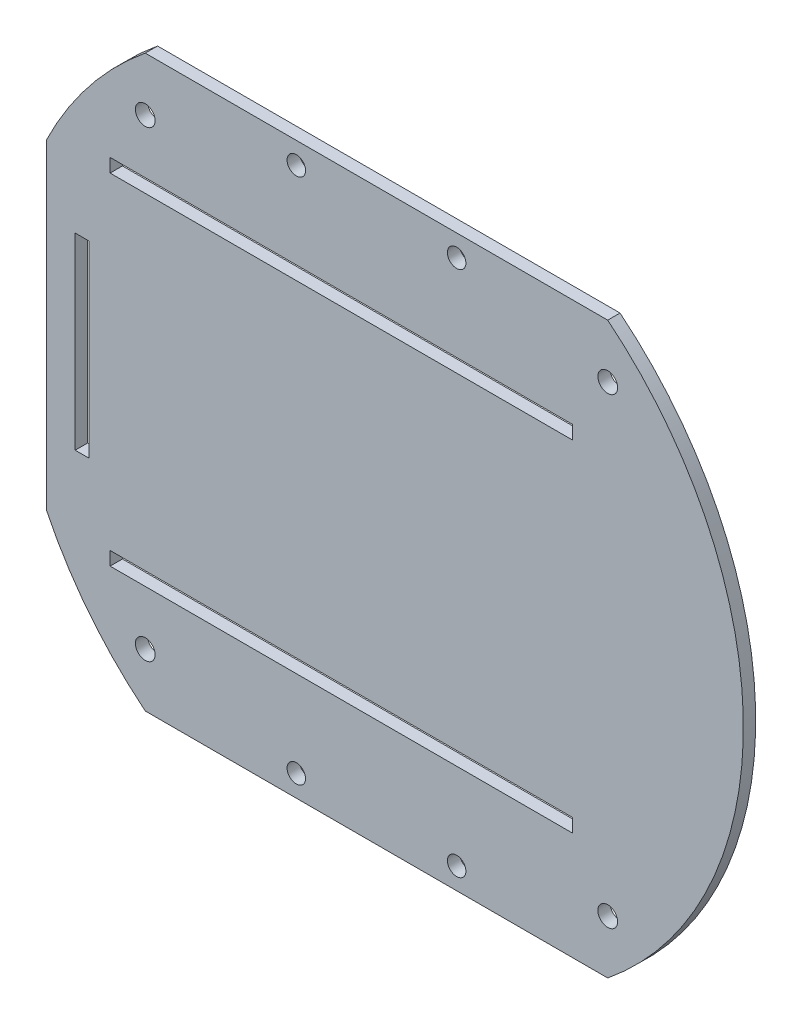
ISO-10303-21;
HEADER;
FILE_DESCRIPTION(('STEP AP214'),'2;1');
FILE_NAME('part.step','',(''),(''),'','','');
FILE_SCHEMA(('AUTOMOTIVE_DESIGN { 1 0 10303 214 1 1 1 1 }'));
ENDSEC;
DATA;
#1=APPLICATION_CONTEXT('core data for automotive mechanical design processes');
#2=APPLICATION_PROTOCOL_DEFINITION('international standard','automotive_design',2000,#1);
#3=PRODUCT_CONTEXT('',#1,'mechanical');
#4=PRODUCT('Part','Part','',(#3));
#5=PRODUCT_RELATED_PRODUCT_CATEGORY('part','',(#4));
#6=PRODUCT_DEFINITION_FORMATION('','',#4);
#7=PRODUCT_DEFINITION_CONTEXT('part definition',#1,'design');
#8=PRODUCT_DEFINITION('design','',#6,#7);
#9=PRODUCT_DEFINITION_SHAPE('','',#8);
#10=(LENGTH_UNIT() NAMED_UNIT(*) SI_UNIT(.MILLI.,.METRE.));
#11=(NAMED_UNIT(*) PLANE_ANGLE_UNIT() SI_UNIT($,.RADIAN.));
#12=(NAMED_UNIT(*) SI_UNIT($,.STERADIAN.) SOLID_ANGLE_UNIT());
#13=UNCERTAINTY_MEASURE_WITH_UNIT(LENGTH_MEASURE(1.E-05),#10,'distance_accuracy_value','');
#14=(GEOMETRIC_REPRESENTATION_CONTEXT(3) GLOBAL_UNCERTAINTY_ASSIGNED_CONTEXT((#13)) GLOBAL_UNIT_ASSIGNED_CONTEXT((#10,
#11,#12)) REPRESENTATION_CONTEXT('',''));
#15=CARTESIAN_POINT('',(0.,0.,0.));
#16=DIRECTION('',(0.,0.,1.));
#17=DIRECTION('',(1.,0.,0.));
#18=AXIS2_PLACEMENT_3D('',#15,#16,#17);
#19=CARTESIAN_POINT('',(0.,0.,2.));
#20=DIRECTION('',(0.,0.,-1.));
#21=DIRECTION('',(-1.,0.,0.));
#22=AXIS2_PLACEMENT_3D('',#19,#20,#21);
#23=CYLINDRICAL_SURFACE('',#22,59.5);
#24=CARTESIAN_POINT('',(0.,0.,0.));
#25=DIRECTION('',(0.,0.,1.));
#26=DIRECTION('',(1.,0.,0.));
#27=AXIS2_PLACEMENT_3D('',#24,#25,#26);
#28=CIRCLE('',#27,59.5);
#29=CARTESIAN_POINT('',(-53.5186883247338,-26.,0.));
#30=VERTEX_POINT('',#29);
#31=CARTESIAN_POINT('',(-37.5,-46.1952378498044,0.));
#32=VERTEX_POINT('',#31);
#33=EDGE_CURVE('E330',#30,#32,#28,.T.);
#34=ORIENTED_EDGE('',*,*,#33,.T.);
#35=DIRECTION('',(0.,0.,1.));
#36=VECTOR('',#35,1.);
#37=CARTESIAN_POINT('',(-37.5,-46.1952378498044,-76.1709701649735));
#38=LINE('',#37,#36);
#39=CARTESIAN_POINT('',(-37.5,-46.1952378498044,2.));
#40=VERTEX_POINT('',#39);
#41=EDGE_CURVE('E49',#32,#40,#38,.T.);
#42=ORIENTED_EDGE('',*,*,#41,.T.);
#43=CARTESIAN_POINT('',(0.,0.,2.));
#44=DIRECTION('',(0.,0.,1.));
#45=DIRECTION('',(1.,0.,0.));
#46=AXIS2_PLACEMENT_3D('',#43,#44,#45);
#47=CIRCLE('',#46,59.5);
#48=CARTESIAN_POINT('',(-53.5186883247338,-26.,2.));
#49=VERTEX_POINT('',#48);
#50=EDGE_CURVE('E41',#49,#40,#47,.T.);
#51=ORIENTED_EDGE('',*,*,#50,.F.);
#52=DIRECTION('',(0.,0.,1.));
#53=VECTOR('',#52,1.);
#54=CARTESIAN_POINT('',(-53.5186883247338,-26.,-76.1709701649735));
#55=LINE('',#54,#53);
#56=EDGE_CURVE('E182',#30,#49,#55,.T.);
#57=ORIENTED_EDGE('',*,*,#56,.F.);
#58=EDGE_LOOP('',(#34,#42,#51,#57));
#59=FACE_BOUND('',#58,.T.);
#60=ADVANCED_FACE('F32',(#59),#23,.T.);
#61=CARTESIAN_POINT('',(-37.5,46.1952378498044,2.));
#62=VERTEX_POINT('',#61);
#63=CARTESIAN_POINT('',(-53.5186883247338,26.,2.));
#64=VERTEX_POINT('',#63);
#65=EDGE_CURVE('E11',#62,#64,#47,.T.);
#66=ORIENTED_EDGE('',*,*,#65,.F.);
#67=DIRECTION('',(0.,0.,1.));
#68=VECTOR('',#67,1.);
#69=CARTESIAN_POINT('',(-37.5,46.1952378498044,-76.1709701649735));
#70=LINE('',#69,#68);
#71=CARTESIAN_POINT('',(-37.5,46.1952378498044,0.));
#72=VERTEX_POINT('',#71);
#73=EDGE_CURVE('E158',#72,#62,#70,.T.);
#74=ORIENTED_EDGE('',*,*,#73,.F.);
#75=CARTESIAN_POINT('',(-53.5186883247338,26.,0.));
#76=VERTEX_POINT('',#75);
#77=EDGE_CURVE('E181',#72,#76,#28,.T.);
#78=ORIENTED_EDGE('',*,*,#77,.T.);
#79=DIRECTION('',(0.,0.,1.));
#80=VECTOR('',#79,1.);
#81=CARTESIAN_POINT('',(-53.5186883247338,26.,-76.1709701649735));
#82=LINE('',#81,#80);
#83=EDGE_CURVE('E57',#76,#64,#82,.T.);
#84=ORIENTED_EDGE('',*,*,#83,.T.);
#85=EDGE_LOOP('',(#66,#74,#78,#84));
#86=FACE_BOUND('',#85,.T.);
#87=ADVANCED_FACE('F180',(#86),#23,.T.);
#88=CARTESIAN_POINT('',(37.5,-46.1952378498044,2.));
#89=VERTEX_POINT('',#88);
#90=CARTESIAN_POINT('',(37.5,46.1952378498044,2.));
#91=VERTEX_POINT('',#90);
#92=EDGE_CURVE('E42',#89,#91,#47,.T.);
#93=ORIENTED_EDGE('',*,*,#92,.F.);
#94=DIRECTION('',(0.,0.,1.));
#95=VECTOR('',#94,1.);
#96=CARTESIAN_POINT('',(37.5,-46.1952378498044,-76.1709701649735));
#97=LINE('',#96,#95);
#98=CARTESIAN_POINT('',(37.5,-46.1952378498044,0.));
#99=VERTEX_POINT('',#98);
#100=EDGE_CURVE('E199',#99,#89,#97,.T.);
#101=ORIENTED_EDGE('',*,*,#100,.F.);
#102=CARTESIAN_POINT('',(37.5,46.1952378498044,0.));
#103=VERTEX_POINT('',#102);
#104=EDGE_CURVE('E36',#99,#103,#28,.T.);
#105=ORIENTED_EDGE('',*,*,#104,.T.);
#106=DIRECTION('',(0.,0.,1.));
#107=VECTOR('',#106,1.);
#108=CARTESIAN_POINT('',(37.5,46.1952378498044,-76.1709701649735));
#109=LINE('',#108,#107);
#110=EDGE_CURVE('E169',#103,#91,#109,.T.);
#111=ORIENTED_EDGE('',*,*,#110,.T.);
#112=EDGE_LOOP('',(#93,#101,#105,#111));
#113=FACE_BOUND('',#112,.T.);
#114=ADVANCED_FACE('F34',(#113),#23,.T.);
#115=CARTESIAN_POINT('',(0.,0.,2.));
#116=DIRECTION('',(0.,0.,1.));
#117=DIRECTION('',(1.,0.,0.));
#118=AXIS2_PLACEMENT_3D('',#115,#116,#117);
#119=PLANE('',#118);
#120=DIRECTION('',(-1.,0.,0.));
#121=VECTOR('',#120,1.);
#122=CARTESIAN_POINT('',(-37.5,-46.1952378498044,2.));
#123=LINE('',#122,#121);
#124=EDGE_CURVE('E197',#89,#40,#123,.T.);
#125=ORIENTED_EDGE('',*,*,#124,.F.);
#126=ORIENTED_EDGE('',*,*,#92,.T.);
#127=DIRECTION('',(1.,0.,0.));
#128=VECTOR('',#127,1.);
#129=CARTESIAN_POINT('',(-37.5,46.1952378498044,2.));
#130=LINE('',#129,#128);
#131=EDGE_CURVE('E161',#62,#91,#130,.T.);
#132=ORIENTED_EDGE('',*,*,#131,.F.);
#133=ORIENTED_EDGE('',*,*,#65,.T.);
#134=DIRECTION('',(0.,1.,0.));
#135=VECTOR('',#134,1.);
#136=CARTESIAN_POINT('',(-53.5186883247338,26.,2.));
#137=LINE('',#136,#135);
#138=EDGE_CURVE('E183',#49,#64,#137,.T.);
#139=ORIENTED_EDGE('',*,*,#138,.F.);
#140=ORIENTED_EDGE('',*,*,#50,.T.);
#141=EDGE_LOOP('',(#125,#126,#132,#133,#139,#140));
#142=FACE_BOUND('',#141,.T.);
#143=CARTESIAN_POINT('',(13.,42.7,2.));
#144=DIRECTION('',(0.,0.,1.));
#145=DIRECTION('',(1.,0.,0.));
#146=AXIS2_PLACEMENT_3D('',#143,#144,#145);
#147=CIRCLE('',#146,1.5);
#148=CARTESIAN_POINT('',(14.5,42.7,2.));
#149=VERTEX_POINT('',#148);
#150=EDGE_CURVE('E188',#149,#149,#147,.T.);
#151=ORIENTED_EDGE('',*,*,#150,.F.);
#152=EDGE_LOOP('',(#151));
#153=FACE_BOUND('',#152,.T.);
#154=CARTESIAN_POINT('',(-13.,42.7,2.));
#155=DIRECTION('',(0.,0.,1.));
#156=DIRECTION('',(1.,0.,0.));
#157=AXIS2_PLACEMENT_3D('',#154,#155,#156);
#158=CIRCLE('',#157,1.50000000000001);
#159=CARTESIAN_POINT('',(-11.5,42.7,2.));
#160=VERTEX_POINT('',#159);
#161=EDGE_CURVE('E195',#160,#160,#158,.T.);
#162=ORIENTED_EDGE('',*,*,#161,.F.);
#163=EDGE_LOOP('',(#162));
#164=FACE_BOUND('',#163,.T.);
#165=CARTESIAN_POINT('',(13.,-42.7,2.));
#166=DIRECTION('',(0.,0.,1.));
#167=DIRECTION('',(1.,0.,0.));
#168=AXIS2_PLACEMENT_3D('',#165,#166,#167);
#169=CIRCLE('',#168,1.5);
#170=CARTESIAN_POINT('',(14.5,-42.7,2.));
#171=VERTEX_POINT('',#170);
#172=EDGE_CURVE('E202',#171,#171,#169,.T.);
#173=ORIENTED_EDGE('',*,*,#172,.F.);
#174=EDGE_LOOP('',(#173));
#175=FACE_BOUND('',#174,.T.);
#176=CARTESIAN_POINT('',(-13.,-42.7,2.));
#177=DIRECTION('',(0.,0.,1.));
#178=DIRECTION('',(1.,0.,0.));
#179=AXIS2_PLACEMENT_3D('',#176,#177,#178);
#180=CIRCLE('',#179,1.5);
#181=CARTESIAN_POINT('',(-11.5,-42.7,2.));
#182=VERTEX_POINT('',#181);
#183=EDGE_CURVE('E209',#182,#182,#180,.T.);
#184=ORIENTED_EDGE('',*,*,#183,.F.);
#185=EDGE_LOOP('',(#184));
#186=FACE_BOUND('',#185,.T.);
#187=CARTESIAN_POINT('',(37.5,37.5,2.));
#188=DIRECTION('',(0.,0.,1.));
#189=DIRECTION('',(1.,0.,0.));
#190=AXIS2_PLACEMENT_3D('',#187,#188,#189);
#191=CIRCLE('',#190,1.6);
#192=CARTESIAN_POINT('',(39.1,37.5,2.));
#193=VERTEX_POINT('',#192);
#194=EDGE_CURVE('E219',#193,#193,#191,.T.);
#195=ORIENTED_EDGE('',*,*,#194,.F.);
#196=EDGE_LOOP('',(#195));
#197=FACE_BOUND('',#196,.T.);
#198=CARTESIAN_POINT('',(-37.5,37.5,2.));
#199=DIRECTION('',(0.,0.,1.));
#200=DIRECTION('',(1.,0.,0.));
#201=AXIS2_PLACEMENT_3D('',#198,#199,#200);
#202=CIRCLE('',#201,1.60000000000001);
#203=CARTESIAN_POINT('',(-35.9,37.5,2.));
#204=VERTEX_POINT('',#203);
#205=EDGE_CURVE('E292',#204,#204,#202,.T.);
#206=ORIENTED_EDGE('',*,*,#205,.F.);
#207=EDGE_LOOP('',(#206));
#208=FACE_BOUND('',#207,.T.);
#209=DIRECTION('',(0.,-1.,0.));
#210=VECTOR('',#209,1.);
#211=CARTESIAN_POINT('',(-43.197175449376,-26.5,2.));
#212=LINE('',#211,#210);
#213=CARTESIAN_POINT('',(-43.197175449376,-26.5,2.));
#214=VERTEX_POINT('',#213);
#215=CARTESIAN_POINT('',(-43.197175449376,-28.7,2.));
#216=VERTEX_POINT('',#215);
#217=EDGE_CURVE('E266',#214,#216,#212,.T.);
#218=ORIENTED_EDGE('',*,*,#217,.F.);
#219=DIRECTION('',(-1.,0.,0.));
#220=VECTOR('',#219,1.);
#221=CARTESIAN_POINT('',(-43.197175449376,-26.5,2.));
#222=LINE('',#221,#220);
#223=CARTESIAN_POINT('',(31.802824550624,-26.5,2.));
#224=VERTEX_POINT('',#223);
#225=EDGE_CURVE('E275',#224,#214,#222,.T.);
#226=ORIENTED_EDGE('',*,*,#225,.F.);
#227=DIRECTION('',(0.,1.,0.));
#228=VECTOR('',#227,1.);
#229=CARTESIAN_POINT('',(31.802824550624,-26.5,2.));
#230=LINE('',#229,#228);
#231=CARTESIAN_POINT('',(31.802824550624,-28.7,2.));
#232=VERTEX_POINT('',#231);
#233=EDGE_CURVE('E272',#232,#224,#230,.T.);
#234=ORIENTED_EDGE('',*,*,#233,.F.);
#235=DIRECTION('',(1.,0.,0.));
#236=VECTOR('',#235,1.);
#237=CARTESIAN_POINT('',(-43.197175449376,-28.7,2.));
#238=LINE('',#237,#236);
#239=EDGE_CURVE('E268',#216,#232,#238,.T.);
#240=ORIENTED_EDGE('',*,*,#239,.F.);
#241=EDGE_LOOP('',(#218,#226,#234,#240));
#242=FACE_BOUND('',#241,.T.);
#243=CARTESIAN_POINT('',(37.5,-37.5,2.));
#244=DIRECTION('',(0.,0.,1.));
#245=DIRECTION('',(1.,0.,0.));
#246=AXIS2_PLACEMENT_3D('',#243,#244,#245);
#247=CIRCLE('',#246,1.6);
#248=CARTESIAN_POINT('',(39.1,-37.5,2.));
#249=VERTEX_POINT('',#248);
#250=EDGE_CURVE('E250',#249,#249,#247,.T.);
#251=ORIENTED_EDGE('',*,*,#250,.F.);
#252=EDGE_LOOP('',(#251));
#253=FACE_BOUND('',#252,.T.);
#254=DIRECTION('',(0.,-1.,0.));
#255=VECTOR('',#254,1.);
#256=CARTESIAN_POINT('',(-48.8589023812688,15.25,2.));
#257=LINE('',#256,#255);
#258=CARTESIAN_POINT('',(-48.8589023812688,15.25,2.));
#259=VERTEX_POINT('',#258);
#260=CARTESIAN_POINT('',(-48.8589023812688,-15.25,2.));
#261=VERTEX_POINT('',#260);
#262=EDGE_CURVE('E229',#259,#261,#257,.T.);
#263=ORIENTED_EDGE('',*,*,#262,.F.);
#264=DIRECTION('',(-1.,0.,0.));
#265=VECTOR('',#264,1.);
#266=CARTESIAN_POINT('',(-48.8589023812688,15.25,2.));
#267=LINE('',#266,#265);
#268=CARTESIAN_POINT('',(-46.6589023812688,15.25,2.));
#269=VERTEX_POINT('',#268);
#270=EDGE_CURVE('E238',#269,#259,#267,.T.);
#271=ORIENTED_EDGE('',*,*,#270,.F.);
#272=DIRECTION('',(0.,1.,0.));
#273=VECTOR('',#272,1.);
#274=CARTESIAN_POINT('',(-46.6589023812688,15.25,2.));
#275=LINE('',#274,#273);
#276=CARTESIAN_POINT('',(-46.6589023812688,-15.25,2.));
#277=VERTEX_POINT('',#276);
#278=EDGE_CURVE('E235',#277,#269,#275,.T.);
#279=ORIENTED_EDGE('',*,*,#278,.F.);
#280=DIRECTION('',(1.,0.,0.));
#281=VECTOR('',#280,1.);
#282=CARTESIAN_POINT('',(-48.8589023812688,-15.25,2.));
#283=LINE('',#282,#281);
#284=EDGE_CURVE('E231',#261,#277,#283,.T.);
#285=ORIENTED_EDGE('',*,*,#284,.F.);
#286=EDGE_LOOP('',(#263,#271,#279,#285));
#287=FACE_BOUND('',#286,.T.);
#288=CARTESIAN_POINT('',(-37.5,-37.5,2.));
#289=DIRECTION('',(0.,0.,1.));
#290=DIRECTION('',(1.,0.,0.));
#291=AXIS2_PLACEMENT_3D('',#288,#289,#290);
#292=CIRCLE('',#291,1.6);
#293=CARTESIAN_POINT('',(-35.9,-37.5,2.));
#294=VERTEX_POINT('',#293);
#295=EDGE_CURVE('E251',#294,#294,#292,.T.);
#296=ORIENTED_EDGE('',*,*,#295,.F.);
#297=EDGE_LOOP('',(#296));
#298=FACE_BOUND('',#297,.T.);
#299=DIRECTION('',(0.,-1.,0.));
#300=VECTOR('',#299,1.);
#301=CARTESIAN_POINT('',(-43.197175449376,28.7,2.));
#302=LINE('',#301,#300);
#303=CARTESIAN_POINT('',(-43.197175449376,28.7,2.));
#304=VERTEX_POINT('',#303);
#305=CARTESIAN_POINT('',(-43.197175449376,26.5,2.));
#306=VERTEX_POINT('',#305);
#307=EDGE_CURVE('E287',#304,#306,#302,.T.);
#308=ORIENTED_EDGE('',*,*,#307,.F.);
#309=DIRECTION('',(-1.,0.,0.));
#310=VECTOR('',#309,1.);
#311=CARTESIAN_POINT('',(-43.197175449376,28.7,2.));
#312=LINE('',#311,#310);
#313=CARTESIAN_POINT('',(31.802824550624,28.7,2.));
#314=VERTEX_POINT('',#313);
#315=EDGE_CURVE('E318',#314,#304,#312,.T.);
#316=ORIENTED_EDGE('',*,*,#315,.F.);
#317=DIRECTION('',(0.,1.,0.));
#318=VECTOR('',#317,1.);
#319=CARTESIAN_POINT('',(31.802824550624,28.7,2.));
#320=LINE('',#319,#318);
#321=CARTESIAN_POINT('',(31.802824550624,26.5,2.));
#322=VERTEX_POINT('',#321);
#323=EDGE_CURVE('E315',#322,#314,#320,.T.);
#324=ORIENTED_EDGE('',*,*,#323,.F.);
#325=DIRECTION('',(1.,0.,0.));
#326=VECTOR('',#325,1.);
#327=CARTESIAN_POINT('',(-43.197175449376,26.5,2.));
#328=LINE('',#327,#326);
#329=EDGE_CURVE('E312',#306,#322,#328,.T.);
#330=ORIENTED_EDGE('',*,*,#329,.F.);
#331=EDGE_LOOP('',(#308,#316,#324,#330));
#332=FACE_BOUND('',#331,.T.);
#333=ADVANCED_FACE('F174',(#142,#153,#164,#175,#186,#197,#208,#242,#253,#287,#298,#332),#119,.T.);
#334=CARTESIAN_POINT('',(0.,0.,0.));
#335=DIRECTION('',(0.,0.,1.));
#336=DIRECTION('',(1.,0.,0.));
#337=AXIS2_PLACEMENT_3D('',#334,#335,#336);
#338=PLANE('',#337);
#339=CARTESIAN_POINT('',(13.,42.7,0.));
#340=DIRECTION('',(0.,0.,1.));
#341=DIRECTION('',(1.,0.,0.));
#342=AXIS2_PLACEMENT_3D('',#339,#340,#341);
#343=CIRCLE('',#342,1.5);
#344=CARTESIAN_POINT('',(14.5,42.7,0.));
#345=VERTEX_POINT('',#344);
#346=EDGE_CURVE('E191',#345,#345,#343,.F.);
#347=ORIENTED_EDGE('',*,*,#346,.F.);
#348=EDGE_LOOP('',(#347));
#349=FACE_BOUND('',#348,.T.);
#350=CARTESIAN_POINT('',(-13.,42.7,0.));
#351=DIRECTION('',(0.,0.,1.));
#352=DIRECTION('',(1.,0.,0.));
#353=AXIS2_PLACEMENT_3D('',#350,#351,#352);
#354=CIRCLE('',#353,1.50000000000001);
#355=CARTESIAN_POINT('',(-11.5,42.7,0.));
#356=VERTEX_POINT('',#355);
#357=EDGE_CURVE('E206',#356,#356,#354,.F.);
#358=ORIENTED_EDGE('',*,*,#357,.F.);
#359=EDGE_LOOP('',(#358));
#360=FACE_BOUND('',#359,.T.);
#361=CARTESIAN_POINT('',(13.,-42.7,0.));
#362=DIRECTION('',(0.,0.,1.));
#363=DIRECTION('',(1.,0.,0.));
#364=AXIS2_PLACEMENT_3D('',#361,#362,#363);
#365=CIRCLE('',#364,1.5);
#366=CARTESIAN_POINT('',(14.5,-42.7,0.));
#367=VERTEX_POINT('',#366);
#368=EDGE_CURVE('E205',#367,#367,#365,.F.);
#369=ORIENTED_EDGE('',*,*,#368,.F.);
#370=EDGE_LOOP('',(#369));
#371=FACE_BOUND('',#370,.T.);
#372=CARTESIAN_POINT('',(-13.,-42.7,0.));
#373=DIRECTION('',(0.,0.,1.));
#374=DIRECTION('',(1.,0.,0.));
#375=AXIS2_PLACEMENT_3D('',#372,#373,#374);
#376=CIRCLE('',#375,1.5);
#377=CARTESIAN_POINT('',(-11.5,-42.7,0.));
#378=VERTEX_POINT('',#377);
#379=EDGE_CURVE('E216',#378,#378,#376,.F.);
#380=ORIENTED_EDGE('',*,*,#379,.F.);
#381=EDGE_LOOP('',(#380));
#382=FACE_BOUND('',#381,.T.);
#383=CARTESIAN_POINT('',(37.5,37.5,0.));
#384=DIRECTION('',(0.,0.,1.));
#385=DIRECTION('',(1.,0.,0.));
#386=AXIS2_PLACEMENT_3D('',#383,#384,#385);
#387=CIRCLE('',#386,1.6);
#388=CARTESIAN_POINT('',(39.1,37.5,0.));
#389=VERTEX_POINT('',#388);
#390=EDGE_CURVE('E295',#389,#389,#387,.F.);
#391=ORIENTED_EDGE('',*,*,#390,.F.);
#392=EDGE_LOOP('',(#391));
#393=FACE_BOUND('',#392,.T.);
#394=CARTESIAN_POINT('',(-37.5,37.5,0.));
#395=DIRECTION('',(0.,0.,1.));
#396=DIRECTION('',(1.,0.,0.));
#397=AXIS2_PLACEMENT_3D('',#394,#395,#396);
#398=CIRCLE('',#397,1.60000000000001);
#399=CARTESIAN_POINT('',(-35.9,37.5,0.));
#400=VERTEX_POINT('',#399);
#401=EDGE_CURVE('E254',#400,#400,#398,.F.);
#402=ORIENTED_EDGE('',*,*,#401,.F.);
#403=EDGE_LOOP('',(#402));
#404=FACE_BOUND('',#403,.T.);
#405=DIRECTION('',(1.,0.,0.));
#406=VECTOR('',#405,1.);
#407=CARTESIAN_POINT('',(-43.197175449376,-26.5,0.));
#408=LINE('',#407,#406);
#409=CARTESIAN_POINT('',(-43.197175449376,-26.5,0.));
#410=VERTEX_POINT('',#409);
#411=CARTESIAN_POINT('',(31.802824550624,-26.5,0.));
#412=VERTEX_POINT('',#411);
#413=EDGE_CURVE('E260',#410,#412,#408,.T.);
#414=ORIENTED_EDGE('',*,*,#413,.F.);
#415=DIRECTION('',(0.,1.,0.));
#416=VECTOR('',#415,1.);
#417=CARTESIAN_POINT('',(-43.197175449376,-26.5,0.));
#418=LINE('',#417,#416);
#419=CARTESIAN_POINT('',(-43.197175449376,-28.7,0.));
#420=VERTEX_POINT('',#419);
#421=EDGE_CURVE('E263',#420,#410,#418,.T.);
#422=ORIENTED_EDGE('',*,*,#421,.F.);
#423=DIRECTION('',(-1.,0.,0.));
#424=VECTOR('',#423,1.);
#425=CARTESIAN_POINT('',(-43.197175449376,-28.7,0.));
#426=LINE('',#425,#424);
#427=CARTESIAN_POINT('',(31.802824550624,-28.7,0.));
#428=VERTEX_POINT('',#427);
#429=EDGE_CURVE('E265',#428,#420,#426,.T.);
#430=ORIENTED_EDGE('',*,*,#429,.F.);
#431=DIRECTION('',(0.,-1.,0.));
#432=VECTOR('',#431,1.);
#433=CARTESIAN_POINT('',(31.802824550624,-26.5,0.));
#434=LINE('',#433,#432);
#435=EDGE_CURVE('E257',#412,#428,#434,.T.);
#436=ORIENTED_EDGE('',*,*,#435,.F.);
#437=EDGE_LOOP('',(#414,#422,#430,#436));
#438=FACE_BOUND('',#437,.T.);
#439=CARTESIAN_POINT('',(37.5,-37.5,0.));
#440=DIRECTION('',(0.,0.,1.));
#441=DIRECTION('',(1.,0.,0.));
#442=AXIS2_PLACEMENT_3D('',#439,#440,#441);
#443=CIRCLE('',#442,1.6);
#444=CARTESIAN_POINT('',(39.1,-37.5,0.));
#445=VERTEX_POINT('',#444);
#446=EDGE_CURVE('E269',#445,#445,#443,.F.);
#447=ORIENTED_EDGE('',*,*,#446,.F.);
#448=EDGE_LOOP('',(#447));
#449=FACE_BOUND('',#448,.T.);
#450=DIRECTION('',(1.,0.,0.));
#451=VECTOR('',#450,1.);
#452=CARTESIAN_POINT('',(-48.8589023812688,15.25,0.));
#453=LINE('',#452,#451);
#454=CARTESIAN_POINT('',(-48.8589023812688,15.25,0.));
#455=VERTEX_POINT('',#454);
#456=CARTESIAN_POINT('',(-46.6589023812688,15.25,0.));
#457=VERTEX_POINT('',#456);
#458=EDGE_CURVE('E223',#455,#457,#453,.T.);
#459=ORIENTED_EDGE('',*,*,#458,.F.);
#460=DIRECTION('',(0.,1.,0.));
#461=VECTOR('',#460,1.);
#462=CARTESIAN_POINT('',(-48.8589023812688,15.25,0.));
#463=LINE('',#462,#461);
#464=CARTESIAN_POINT('',(-48.8589023812688,-15.25,0.));
#465=VERTEX_POINT('',#464);
#466=EDGE_CURVE('E226',#465,#455,#463,.T.);
#467=ORIENTED_EDGE('',*,*,#466,.F.);
#468=DIRECTION('',(-1.,0.,0.));
#469=VECTOR('',#468,1.);
#470=CARTESIAN_POINT('',(-48.8589023812688,-15.25,0.));
#471=LINE('',#470,#469);
#472=CARTESIAN_POINT('',(-46.6589023812688,-15.25,0.));
#473=VERTEX_POINT('',#472);
#474=EDGE_CURVE('E228',#473,#465,#471,.T.);
#475=ORIENTED_EDGE('',*,*,#474,.F.);
#476=DIRECTION('',(0.,-1.,0.));
#477=VECTOR('',#476,1.);
#478=CARTESIAN_POINT('',(-46.6589023812688,15.25,0.));
#479=LINE('',#478,#477);
#480=EDGE_CURVE('E220',#457,#473,#479,.T.);
#481=ORIENTED_EDGE('',*,*,#480,.F.);
#482=EDGE_LOOP('',(#459,#467,#475,#481));
#483=FACE_BOUND('',#482,.T.);
#484=CARTESIAN_POINT('',(-37.5,-37.5,0.));
#485=DIRECTION('',(0.,0.,1.));
#486=DIRECTION('',(1.,0.,0.));
#487=AXIS2_PLACEMENT_3D('',#484,#485,#486);
#488=CIRCLE('',#487,1.6);
#489=CARTESIAN_POINT('',(-35.9,-37.5,0.));
#490=VERTEX_POINT('',#489);
#491=EDGE_CURVE('E232',#490,#490,#488,.F.);
#492=ORIENTED_EDGE('',*,*,#491,.F.);
#493=EDGE_LOOP('',(#492));
#494=FACE_BOUND('',#493,.T.);
#495=DIRECTION('',(1.,0.,0.));
#496=VECTOR('',#495,1.);
#497=CARTESIAN_POINT('',(-43.197175449376,28.7,0.));
#498=LINE('',#497,#496);
#499=CARTESIAN_POINT('',(-43.197175449376,28.7,0.));
#500=VERTEX_POINT('',#499);
#501=CARTESIAN_POINT('',(31.802824550624,28.7,0.));
#502=VERTEX_POINT('',#501);
#503=EDGE_CURVE('E305',#500,#502,#498,.T.);
#504=ORIENTED_EDGE('',*,*,#503,.F.);
#505=DIRECTION('',(0.,1.,0.));
#506=VECTOR('',#505,1.);
#507=CARTESIAN_POINT('',(-43.197175449376,28.7,0.));
#508=LINE('',#507,#506);
#509=CARTESIAN_POINT('',(-43.197175449376,26.5,0.));
#510=VERTEX_POINT('',#509);
#511=EDGE_CURVE('E308',#510,#500,#508,.T.);
#512=ORIENTED_EDGE('',*,*,#511,.F.);
#513=DIRECTION('',(-1.,0.,0.));
#514=VECTOR('',#513,1.);
#515=CARTESIAN_POINT('',(-43.197175449376,26.5,0.));
#516=LINE('',#515,#514);
#517=CARTESIAN_POINT('',(31.802824550624,26.5,0.));
#518=VERTEX_POINT('',#517);
#519=EDGE_CURVE('E310',#518,#510,#516,.T.);
#520=ORIENTED_EDGE('',*,*,#519,.F.);
#521=DIRECTION('',(0.,-1.,0.));
#522=VECTOR('',#521,1.);
#523=CARTESIAN_POINT('',(31.802824550624,28.7,0.));
#524=LINE('',#523,#522);
#525=EDGE_CURVE('E302',#502,#518,#524,.T.);
#526=ORIENTED_EDGE('',*,*,#525,.F.);
#527=EDGE_LOOP('',(#504,#512,#520,#526));
#528=FACE_BOUND('',#527,.T.);
#529=ORIENTED_EDGE('',*,*,#104,.F.);
#530=DIRECTION('',(1.,0.,0.));
#531=VECTOR('',#530,1.);
#532=CARTESIAN_POINT('',(-37.5,-46.1952378498044,0.));
#533=LINE('',#532,#531);
#534=EDGE_CURVE('E192',#32,#99,#533,.T.);
#535=ORIENTED_EDGE('',*,*,#534,.F.);
#536=ORIENTED_EDGE('',*,*,#33,.F.);
#537=DIRECTION('',(0.,-1.,0.));
#538=VECTOR('',#537,1.);
#539=CARTESIAN_POINT('',(-53.5186883247338,26.,0.));
#540=LINE('',#539,#538);
#541=EDGE_CURVE('E178',#76,#30,#540,.T.);
#542=ORIENTED_EDGE('',*,*,#541,.F.);
#543=ORIENTED_EDGE('',*,*,#77,.F.);
#544=DIRECTION('',(-1.,0.,0.));
#545=VECTOR('',#544,1.);
#546=CARTESIAN_POINT('',(-37.5,46.1952378498044,0.));
#547=LINE('',#546,#545);
#548=EDGE_CURVE('E164',#103,#72,#547,.T.);
#549=ORIENTED_EDGE('',*,*,#548,.F.);
#550=EDGE_LOOP('',(#529,#535,#536,#542,#543,#549));
#551=FACE_BOUND('',#550,.T.);
#552=ADVANCED_FACE('F337',(#349,#360,#371,#382,#393,#404,#438,#449,#483,#494,#528,#551),#338,.F.);
#553=CARTESIAN_POINT('',(-43.197175449376,28.7,-75.0322597287327));
#554=DIRECTION('',(-1.,0.,0.));
#555=DIRECTION('',(0.,0.,1.));
#556=AXIS2_PLACEMENT_3D('',#553,#554,#555);
#557=PLANE('',#556);
#558=ORIENTED_EDGE('',*,*,#511,.T.);
#559=DIRECTION('',(0.,0.,1.));
#560=VECTOR('',#559,1.);
#561=CARTESIAN_POINT('',(-43.197175449376,28.7,-75.0322597287327));
#562=LINE('',#561,#560);
#563=EDGE_CURVE('E306',#500,#304,#562,.T.);
#564=ORIENTED_EDGE('',*,*,#563,.T.);
#565=ORIENTED_EDGE('',*,*,#307,.T.);
#566=DIRECTION('',(0.,0.,1.));
#567=VECTOR('',#566,1.);
#568=CARTESIAN_POINT('',(-43.197175449376,26.5,-75.0322597287327));
#569=LINE('',#568,#567);
#570=EDGE_CURVE('E321',#510,#306,#569,.T.);
#571=ORIENTED_EDGE('',*,*,#570,.F.);
#572=EDGE_LOOP('',(#558,#564,#565,#571));
#573=FACE_BOUND('',#572,.T.);
#574=ADVANCED_FACE('F370',(#573),#557,.F.);
#575=CARTESIAN_POINT('',(-43.197175449376,28.7,-75.0322597287327));
#576=DIRECTION('',(0.,1.,0.));
#577=DIRECTION('',(-1.,0.,0.));
#578=AXIS2_PLACEMENT_3D('',#575,#576,#577);
#579=PLANE('',#578);
#580=ORIENTED_EDGE('',*,*,#503,.T.);
#581=DIRECTION('',(0.,0.,1.));
#582=VECTOR('',#581,1.);
#583=CARTESIAN_POINT('',(31.802824550624,28.7,-75.0322597287327));
#584=LINE('',#583,#582);
#585=EDGE_CURVE('E323',#502,#314,#584,.T.);
#586=ORIENTED_EDGE('',*,*,#585,.T.);
#587=ORIENTED_EDGE('',*,*,#315,.T.);
#588=ORIENTED_EDGE('',*,*,#563,.F.);
#589=EDGE_LOOP('',(#580,#586,#587,#588));
#590=FACE_BOUND('',#589,.T.);
#591=ADVANCED_FACE('F375',(#590),#579,.F.);
#592=CARTESIAN_POINT('',(31.802824550624,28.7,-75.0322597287327));
#593=DIRECTION('',(1.,0.,0.));
#594=DIRECTION('',(0.,0.,-1.));
#595=AXIS2_PLACEMENT_3D('',#592,#593,#594);
#596=PLANE('',#595);
#597=ORIENTED_EDGE('',*,*,#525,.T.);
#598=DIRECTION('',(0.,0.,1.));
#599=VECTOR('',#598,1.);
#600=CARTESIAN_POINT('',(31.802824550624,26.5,-75.0322597287327));
#601=LINE('',#600,#599);
#602=EDGE_CURVE('E325',#518,#322,#601,.T.);
#603=ORIENTED_EDGE('',*,*,#602,.T.);
#604=ORIENTED_EDGE('',*,*,#323,.T.);
#605=ORIENTED_EDGE('',*,*,#585,.F.);
#606=EDGE_LOOP('',(#597,#603,#604,#605));
#607=FACE_BOUND('',#606,.T.);
#608=ADVANCED_FACE('F381',(#607),#596,.F.);
#609=CARTESIAN_POINT('',(-43.197175449376,26.5,-75.0322597287327));
#610=DIRECTION('',(0.,-1.,0.));
#611=DIRECTION('',(1.,0.,0.));
#612=AXIS2_PLACEMENT_3D('',#609,#610,#611);
#613=PLANE('',#612);
#614=ORIENTED_EDGE('',*,*,#519,.T.);
#615=ORIENTED_EDGE('',*,*,#570,.T.);
#616=ORIENTED_EDGE('',*,*,#329,.T.);
#617=ORIENTED_EDGE('',*,*,#602,.F.);
#618=EDGE_LOOP('',(#614,#615,#616,#617));
#619=FACE_BOUND('',#618,.T.);
#620=ADVANCED_FACE('F377',(#619),#613,.F.);
#621=CARTESIAN_POINT('',(-37.5,-37.5,-75.0322597287327));
#622=DIRECTION('',(0.,0.,1.));
#623=DIRECTION('',(1.,0.,0.));
#624=AXIS2_PLACEMENT_3D('',#621,#622,#623);
#625=CYLINDRICAL_SURFACE('',#624,1.6);
#626=ORIENTED_EDGE('',*,*,#491,.T.);
#627=EDGE_LOOP('',(#626));
#628=FACE_BOUND('',#627,.T.);
#629=ORIENTED_EDGE('',*,*,#295,.T.);
#630=EDGE_LOOP('',(#629));
#631=FACE_BOUND('',#630,.T.);
#632=ADVANCED_FACE('F380',(#628,#631),#625,.F.);
#633=CARTESIAN_POINT('',(-48.8589023812688,15.25,-75.0322597287327));
#634=DIRECTION('',(-1.,0.,0.));
#635=DIRECTION('',(0.,0.,1.));
#636=AXIS2_PLACEMENT_3D('',#633,#634,#635);
#637=PLANE('',#636);
#638=ORIENTED_EDGE('',*,*,#466,.T.);
#639=DIRECTION('',(0.,0.,1.));
#640=VECTOR('',#639,1.);
#641=CARTESIAN_POINT('',(-48.8589023812688,15.25,-75.0322597287327));
#642=LINE('',#641,#640);
#643=EDGE_CURVE('E224',#455,#259,#642,.T.);
#644=ORIENTED_EDGE('',*,*,#643,.T.);
#645=ORIENTED_EDGE('',*,*,#262,.T.);
#646=DIRECTION('',(0.,0.,1.));
#647=VECTOR('',#646,1.);
#648=CARTESIAN_POINT('',(-48.8589023812688,-15.25,-75.0322597287327));
#649=LINE('',#648,#647);
#650=EDGE_CURVE('E241',#465,#261,#649,.T.);
#651=ORIENTED_EDGE('',*,*,#650,.F.);
#652=EDGE_LOOP('',(#638,#644,#645,#651));
#653=FACE_BOUND('',#652,.T.);
#654=ADVANCED_FACE('F421',(#653),#637,.F.);
#655=CARTESIAN_POINT('',(-48.8589023812688,15.25,-75.0322597287327));
#656=DIRECTION('',(0.,1.,0.));
#657=DIRECTION('',(-1.,0.,0.));
#658=AXIS2_PLACEMENT_3D('',#655,#656,#657);
#659=PLANE('',#658);
#660=ORIENTED_EDGE('',*,*,#458,.T.);
#661=DIRECTION('',(0.,0.,1.));
#662=VECTOR('',#661,1.);
#663=CARTESIAN_POINT('',(-46.6589023812688,15.25,-75.0322597287327));
#664=LINE('',#663,#662);
#665=EDGE_CURVE('E243',#457,#269,#664,.T.);
#666=ORIENTED_EDGE('',*,*,#665,.T.);
#667=ORIENTED_EDGE('',*,*,#270,.T.);
#668=ORIENTED_EDGE('',*,*,#643,.F.);
#669=EDGE_LOOP('',(#660,#666,#667,#668));
#670=FACE_BOUND('',#669,.T.);
#671=ADVANCED_FACE('F425',(#670),#659,.F.);
#672=CARTESIAN_POINT('',(-46.6589023812688,15.25,-75.0322597287327));
#673=DIRECTION('',(1.,0.,0.));
#674=DIRECTION('',(0.,1.,0.));
#675=AXIS2_PLACEMENT_3D('',#672,#673,#674);
#676=PLANE('',#675);
#677=ORIENTED_EDGE('',*,*,#480,.T.);
#678=DIRECTION('',(0.,0.,1.));
#679=VECTOR('',#678,1.);
#680=CARTESIAN_POINT('',(-46.6589023812688,-15.25,-75.0322597287327));
#681=LINE('',#680,#679);
#682=EDGE_CURVE('E245',#473,#277,#681,.T.);
#683=ORIENTED_EDGE('',*,*,#682,.T.);
#684=ORIENTED_EDGE('',*,*,#278,.T.);
#685=ORIENTED_EDGE('',*,*,#665,.F.);
#686=EDGE_LOOP('',(#677,#683,#684,#685));
#687=FACE_BOUND('',#686,.T.);
#688=ADVANCED_FACE('F429',(#687),#676,.F.);
#689=CARTESIAN_POINT('',(-48.8589023812688,-15.25,-75.0322597287327));
#690=DIRECTION('',(0.,-1.,0.));
#691=DIRECTION('',(0.,0.,-1.));
#692=AXIS2_PLACEMENT_3D('',#689,#690,#691);
#693=PLANE('',#692);
#694=ORIENTED_EDGE('',*,*,#474,.T.);
#695=ORIENTED_EDGE('',*,*,#650,.T.);
#696=ORIENTED_EDGE('',*,*,#284,.T.);
#697=ORIENTED_EDGE('',*,*,#682,.F.);
#698=EDGE_LOOP('',(#694,#695,#696,#697));
#699=FACE_BOUND('',#698,.T.);
#700=ADVANCED_FACE('F403',(#699),#693,.F.);
#701=CARTESIAN_POINT('',(37.5,-37.5,-75.0322597287327));
#702=DIRECTION('',(0.,0.,1.));
#703=DIRECTION('',(1.,0.,0.));
#704=AXIS2_PLACEMENT_3D('',#701,#702,#703);
#705=CYLINDRICAL_SURFACE('',#704,1.6);
#706=ORIENTED_EDGE('',*,*,#446,.T.);
#707=EDGE_LOOP('',(#706));
#708=FACE_BOUND('',#707,.T.);
#709=ORIENTED_EDGE('',*,*,#250,.T.);
#710=EDGE_LOOP('',(#709));
#711=FACE_BOUND('',#710,.T.);
#712=ADVANCED_FACE('F399',(#708,#711),#705,.F.);
#713=CARTESIAN_POINT('',(-43.197175449376,-26.5,-75.0322597287327));
#714=DIRECTION('',(-1.,0.,0.));
#715=DIRECTION('',(0.,0.,1.));
#716=AXIS2_PLACEMENT_3D('',#713,#714,#715);
#717=PLANE('',#716);
#718=ORIENTED_EDGE('',*,*,#421,.T.);
#719=DIRECTION('',(0.,0.,1.));
#720=VECTOR('',#719,1.);
#721=CARTESIAN_POINT('',(-43.197175449376,-26.5,-75.0322597287327));
#722=LINE('',#721,#720);
#723=EDGE_CURVE('E261',#410,#214,#722,.T.);
#724=ORIENTED_EDGE('',*,*,#723,.T.);
#725=ORIENTED_EDGE('',*,*,#217,.T.);
#726=DIRECTION('',(0.,0.,1.));
#727=VECTOR('',#726,1.);
#728=CARTESIAN_POINT('',(-43.197175449376,-28.7,-75.0322597287327));
#729=LINE('',#728,#727);
#730=EDGE_CURVE('E278',#420,#216,#729,.T.);
#731=ORIENTED_EDGE('',*,*,#730,.F.);
#732=EDGE_LOOP('',(#718,#724,#725,#731));
#733=FACE_BOUND('',#732,.T.);
#734=ADVANCED_FACE('F402',(#733),#717,.F.);
#735=CARTESIAN_POINT('',(-43.197175449376,-26.5,-75.0322597287327));
#736=DIRECTION('',(0.,1.,0.));
#737=DIRECTION('',(-1.,0.,0.));
#738=AXIS2_PLACEMENT_3D('',#735,#736,#737);
#739=PLANE('',#738);
#740=ORIENTED_EDGE('',*,*,#413,.T.);
#741=DIRECTION('',(0.,0.,1.));
#742=VECTOR('',#741,1.);
#743=CARTESIAN_POINT('',(31.802824550624,-26.5,-75.0322597287327));
#744=LINE('',#743,#742);
#745=EDGE_CURVE('E280',#412,#224,#744,.T.);
#746=ORIENTED_EDGE('',*,*,#745,.T.);
#747=ORIENTED_EDGE('',*,*,#225,.T.);
#748=ORIENTED_EDGE('',*,*,#723,.F.);
#749=EDGE_LOOP('',(#740,#746,#747,#748));
#750=FACE_BOUND('',#749,.T.);
#751=ADVANCED_FACE('F407',(#750),#739,.F.);
#752=CARTESIAN_POINT('',(31.802824550624,-26.5,-75.0322597287327));
#753=DIRECTION('',(1.,0.,0.));
#754=DIRECTION('',(0.,1.,0.));
#755=AXIS2_PLACEMENT_3D('',#752,#753,#754);
#756=PLANE('',#755);
#757=ORIENTED_EDGE('',*,*,#435,.T.);
#758=DIRECTION('',(0.,0.,1.));
#759=VECTOR('',#758,1.);
#760=CARTESIAN_POINT('',(31.802824550624,-28.7,-75.0322597287327));
#761=LINE('',#760,#759);
#762=EDGE_CURVE('E282',#428,#232,#761,.T.);
#763=ORIENTED_EDGE('',*,*,#762,.T.);
#764=ORIENTED_EDGE('',*,*,#233,.T.);
#765=ORIENTED_EDGE('',*,*,#745,.F.);
#766=EDGE_LOOP('',(#757,#763,#764,#765));
#767=FACE_BOUND('',#766,.T.);
#768=ADVANCED_FACE('F411',(#767),#756,.F.);
#769=CARTESIAN_POINT('',(-43.197175449376,-28.7,-75.0322597287327));
#770=DIRECTION('',(0.,-1.,0.));
#771=DIRECTION('',(1.,0.,0.));
#772=AXIS2_PLACEMENT_3D('',#769,#770,#771);
#773=PLANE('',#772);
#774=ORIENTED_EDGE('',*,*,#429,.T.);
#775=ORIENTED_EDGE('',*,*,#730,.T.);
#776=ORIENTED_EDGE('',*,*,#239,.T.);
#777=ORIENTED_EDGE('',*,*,#762,.F.);
#778=EDGE_LOOP('',(#774,#775,#776,#777));
#779=FACE_BOUND('',#778,.T.);
#780=ADVANCED_FACE('F397',(#779),#773,.F.);
#781=CARTESIAN_POINT('',(-37.5,37.5,-75.0322597287327));
#782=DIRECTION('',(0.,0.,1.));
#783=DIRECTION('',(1.,0.,0.));
#784=AXIS2_PLACEMENT_3D('',#781,#782,#783);
#785=CYLINDRICAL_SURFACE('',#784,1.60000000000001);
#786=ORIENTED_EDGE('',*,*,#401,.T.);
#787=EDGE_LOOP('',(#786));
#788=FACE_BOUND('',#787,.T.);
#789=ORIENTED_EDGE('',*,*,#205,.T.);
#790=EDGE_LOOP('',(#789));
#791=FACE_BOUND('',#790,.T.);
#792=ADVANCED_FACE('F393',(#788,#791),#785,.F.);
#793=CARTESIAN_POINT('',(37.5,37.5,-75.0322597287327));
#794=DIRECTION('',(0.,0.,1.));
#795=DIRECTION('',(1.,0.,0.));
#796=AXIS2_PLACEMENT_3D('',#793,#794,#795);
#797=CYLINDRICAL_SURFACE('',#796,1.6);
#798=ORIENTED_EDGE('',*,*,#390,.T.);
#799=EDGE_LOOP('',(#798));
#800=FACE_BOUND('',#799,.T.);
#801=ORIENTED_EDGE('',*,*,#194,.T.);
#802=EDGE_LOOP('',(#801));
#803=FACE_BOUND('',#802,.T.);
#804=ADVANCED_FACE('F389',(#800,#803),#797,.F.);
#805=CARTESIAN_POINT('',(-13.,-42.7,-76.1709701649735));
#806=DIRECTION('',(0.,0.,1.));
#807=DIRECTION('',(1.,0.,0.));
#808=AXIS2_PLACEMENT_3D('',#805,#806,#807);
#809=CYLINDRICAL_SURFACE('',#808,1.5);
#810=ORIENTED_EDGE('',*,*,#379,.T.);
#811=EDGE_LOOP('',(#810));
#812=FACE_BOUND('',#811,.T.);
#813=ORIENTED_EDGE('',*,*,#183,.T.);
#814=EDGE_LOOP('',(#813));
#815=FACE_BOUND('',#814,.T.);
#816=ADVANCED_FACE('F392',(#812,#815),#809,.F.);
#817=CARTESIAN_POINT('',(-53.5186883247338,26.,-76.1709701649735));
#818=DIRECTION('',(1.,0.,0.));
#819=DIRECTION('',(0.,0.,-1.));
#820=AXIS2_PLACEMENT_3D('',#817,#818,#819);
#821=PLANE('',#820);
#822=ORIENTED_EDGE('',*,*,#541,.T.);
#823=ORIENTED_EDGE('',*,*,#56,.T.);
#824=ORIENTED_EDGE('',*,*,#138,.T.);
#825=ORIENTED_EDGE('',*,*,#83,.F.);
#826=EDGE_LOOP('',(#822,#823,#824,#825));
#827=FACE_BOUND('',#826,.T.);
#828=ADVANCED_FACE('F343',(#827),#821,.F.);
#829=CARTESIAN_POINT('',(-37.5,46.1952378498044,-76.1709701649735));
#830=DIRECTION('',(0.,-1.,0.));
#831=DIRECTION('',(0.,0.,-1.));
#832=AXIS2_PLACEMENT_3D('',#829,#830,#831);
#833=PLANE('',#832);
#834=ORIENTED_EDGE('',*,*,#548,.T.);
#835=ORIENTED_EDGE('',*,*,#73,.T.);
#836=ORIENTED_EDGE('',*,*,#131,.T.);
#837=ORIENTED_EDGE('',*,*,#110,.F.);
#838=EDGE_LOOP('',(#834,#835,#836,#837));
#839=FACE_BOUND('',#838,.T.);
#840=ADVANCED_FACE('F160',(#839),#833,.F.);
#841=CARTESIAN_POINT('',(13.,-42.7,-76.1709701649735));
#842=DIRECTION('',(0.,0.,1.));
#843=DIRECTION('',(1.,0.,0.));
#844=AXIS2_PLACEMENT_3D('',#841,#842,#843);
#845=CYLINDRICAL_SURFACE('',#844,1.5);
#846=ORIENTED_EDGE('',*,*,#368,.T.);
#847=EDGE_LOOP('',(#846));
#848=FACE_BOUND('',#847,.T.);
#849=ORIENTED_EDGE('',*,*,#172,.T.);
#850=EDGE_LOOP('',(#849));
#851=FACE_BOUND('',#850,.T.);
#852=ADVANCED_FACE('F441',(#848,#851),#845,.F.);
#853=CARTESIAN_POINT('',(-13.,42.7,-76.1709701649735));
#854=DIRECTION('',(0.,0.,1.));
#855=DIRECTION('',(1.,0.,0.));
#856=AXIS2_PLACEMENT_3D('',#853,#854,#855);
#857=CYLINDRICAL_SURFACE('',#856,1.50000000000001);
#858=ORIENTED_EDGE('',*,*,#357,.T.);
#859=EDGE_LOOP('',(#858));
#860=FACE_BOUND('',#859,.T.);
#861=ORIENTED_EDGE('',*,*,#161,.T.);
#862=EDGE_LOOP('',(#861));
#863=FACE_BOUND('',#862,.T.);
#864=ADVANCED_FACE('F353',(#860,#863),#857,.F.);
#865=CARTESIAN_POINT('',(13.,42.7,-76.1709701649735));
#866=DIRECTION('',(0.,0.,1.));
#867=DIRECTION('',(1.,0.,0.));
#868=AXIS2_PLACEMENT_3D('',#865,#866,#867);
#869=CYLINDRICAL_SURFACE('',#868,1.5);
#870=ORIENTED_EDGE('',*,*,#346,.T.);
#871=EDGE_LOOP('',(#870));
#872=FACE_BOUND('',#871,.T.);
#873=ORIENTED_EDGE('',*,*,#150,.T.);
#874=EDGE_LOOP('',(#873));
#875=FACE_BOUND('',#874,.T.);
#876=ADVANCED_FACE('F348',(#872,#875),#869,.F.);
#877=CARTESIAN_POINT('',(-37.5,-46.1952378498044,-76.1709701649735));
#878=DIRECTION('',(0.,1.,0.));
#879=DIRECTION('',(0.,0.,1.));
#880=AXIS2_PLACEMENT_3D('',#877,#878,#879);
#881=PLANE('',#880);
#882=ORIENTED_EDGE('',*,*,#534,.T.);
#883=ORIENTED_EDGE('',*,*,#100,.T.);
#884=ORIENTED_EDGE('',*,*,#124,.T.);
#885=ORIENTED_EDGE('',*,*,#41,.F.);
#886=EDGE_LOOP('',(#882,#883,#884,#885));
#887=FACE_BOUND('',#886,.T.);
#888=ADVANCED_FACE('F346',(#887),#881,.F.);
#889=CLOSED_SHELL('',(#60,#87,#114,#333,#552,#574,#591,#608,#620,#632,#654,#671,#688,#700,#712,
#734,#751,#768,#780,#792,#804,#816,#828,#840,#852,#864,#876,#888));
#890=MANIFOLD_SOLID_BREP('B2',#889);
#891=ADVANCED_BREP_SHAPE_REPRESENTATION('',(#18,#890),#14);
#892=SHAPE_DEFINITION_REPRESENTATION(#9,#891);
ENDSEC;
END-ISO-10303-21;
